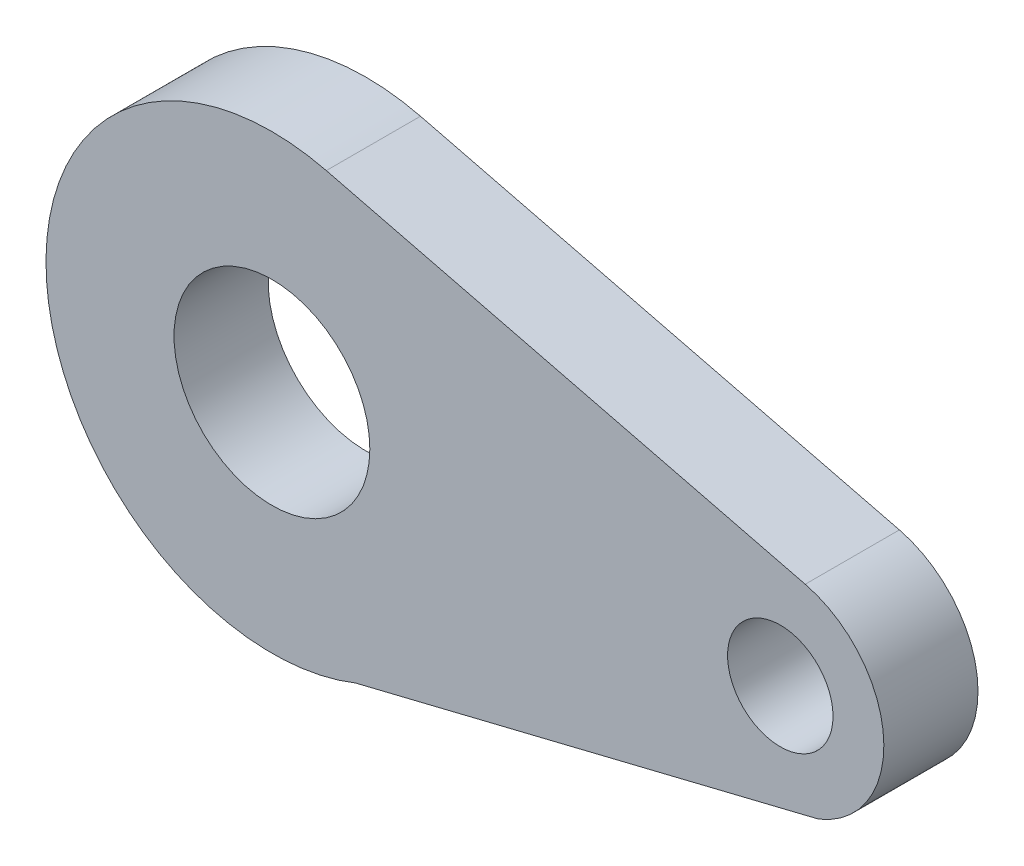
ISO-10303-21;
HEADER;
FILE_DESCRIPTION(('STEP AP214'),'2;1');
FILE_NAME('part.step','',(''),(''),'','','');
FILE_SCHEMA(('AUTOMOTIVE_DESIGN { 1 0 10303 214 1 1 1 1 }'));
ENDSEC;
DATA;
#1=APPLICATION_CONTEXT('core data for automotive mechanical design processes');
#2=APPLICATION_PROTOCOL_DEFINITION('international standard','automotive_design',2000,#1);
#3=PRODUCT_CONTEXT('',#1,'mechanical');
#4=PRODUCT('Part','Part','',(#3));
#5=PRODUCT_RELATED_PRODUCT_CATEGORY('part','',(#4));
#6=PRODUCT_DEFINITION_FORMATION('','',#4);
#7=PRODUCT_DEFINITION_CONTEXT('part definition',#1,'design');
#8=PRODUCT_DEFINITION('design','',#6,#7);
#9=PRODUCT_DEFINITION_SHAPE('','',#8);
#10=(LENGTH_UNIT() NAMED_UNIT(*) SI_UNIT(.MILLI.,.METRE.));
#11=(NAMED_UNIT(*) PLANE_ANGLE_UNIT() SI_UNIT($,.RADIAN.));
#12=(NAMED_UNIT(*) SI_UNIT($,.STERADIAN.) SOLID_ANGLE_UNIT());
#13=UNCERTAINTY_MEASURE_WITH_UNIT(LENGTH_MEASURE(1.E-05),#10,'distance_accuracy_value','');
#14=(GEOMETRIC_REPRESENTATION_CONTEXT(3) GLOBAL_UNCERTAINTY_ASSIGNED_CONTEXT((#13)) GLOBAL_UNIT_ASSIGNED_CONTEXT((#10,
#11,#12)) REPRESENTATION_CONTEXT('',''));
#15=CARTESIAN_POINT('',(0.,0.,0.));
#16=DIRECTION('',(0.,0.,1.));
#17=DIRECTION('',(1.,0.,0.));
#18=AXIS2_PLACEMENT_3D('',#15,#16,#17);
#19=CARTESIAN_POINT('',(0.,0.,2.5));
#20=DIRECTION('',(0.,0.,1.));
#21=DIRECTION('',(1.,0.,0.));
#22=AXIS2_PLACEMENT_3D('',#19,#20,#21);
#23=PLANE('',#22);
#24=CARTESIAN_POINT('',(0.,0.,2.5));
#25=DIRECTION('',(0.,0.,1.));
#26=DIRECTION('',(1.,0.,0.));
#27=AXIS2_PLACEMENT_3D('',#24,#25,#26);
#28=CIRCLE('',#27,2.6);
#29=CARTESIAN_POINT('',(2.6,0.,2.5));
#30=VERTEX_POINT('',#29);
#31=EDGE_CURVE('E100',#30,#30,#28,.T.);
#32=ORIENTED_EDGE('',*,*,#31,.F.);
#33=EDGE_LOOP('',(#32));
#34=FACE_BOUND('',#33,.T.);
#35=CARTESIAN_POINT('',(0.,0.,2.5));
#36=DIRECTION('',(0.,0.,1.));
#37=DIRECTION('',(1.,0.,0.));
#38=AXIS2_PLACEMENT_3D('',#35,#36,#37);
#39=CIRCLE('',#38,6.);
#40=CARTESIAN_POINT('',(1.44444444444445,5.8235367472794,2.5));
#41=VERTEX_POINT('',#40);
#42=CARTESIAN_POINT('',(2.22222222222222,-5.57330497954865,2.5));
#43=VERTEX_POINT('',#42);
#44=EDGE_CURVE('E85',#41,#43,#39,.T.);
#45=ORIENTED_EDGE('',*,*,#44,.T.);
#46=DIRECTION('',(0.971159641560586,0.238430179725458,0.));
#47=VECTOR('',#46,1.);
#48=CARTESIAN_POINT('',(14.5185185185185,-2.5544314489598,2.5));
#49=LINE('',#48,#47);
#50=CARTESIAN_POINT('',(14.5185185185185,-2.5544314489598,2.5));
#51=VERTEX_POINT('',#50);
#52=EDGE_CURVE('E80',#43,#51,#49,.T.);
#53=ORIENTED_EDGE('',*,*,#52,.T.);
#54=CARTESIAN_POINT('',(13.5,0.,2.5));
#55=DIRECTION('',(0.,0.,1.));
#56=DIRECTION('',(1.,0.,0.));
#57=AXIS2_PLACEMENT_3D('',#54,#55,#56);
#58=CIRCLE('',#57,2.75);
#59=CARTESIAN_POINT('',(14.162037037037,2.66912100916973,2.5));
#60=VERTEX_POINT('',#59);
#61=EDGE_CURVE('E83',#51,#60,#58,.T.);
#62=ORIENTED_EDGE('',*,*,#61,.T.);
#63=DIRECTION('',(-0.970589457879901,0.240740740740741,0.));
#64=VECTOR('',#63,1.);
#65=CARTESIAN_POINT('',(1.44444444444445,5.8235367472794,2.5));
#66=LINE('',#65,#64);
#67=EDGE_CURVE('E50',#60,#41,#66,.T.);
#68=ORIENTED_EDGE('',*,*,#67,.T.);
#69=EDGE_LOOP('',(#45,#53,#62,#68));
#70=FACE_BOUND('',#69,.T.);
#71=CARTESIAN_POINT('',(13.5,0.,2.5));
#72=DIRECTION('',(0.,0.,1.));
#73=DIRECTION('',(1.,0.,0.));
#74=AXIS2_PLACEMENT_3D('',#71,#72,#73);
#75=CIRCLE('',#74,1.4);
#76=CARTESIAN_POINT('',(14.9,0.,2.5));
#77=VERTEX_POINT('',#76);
#78=EDGE_CURVE('E115',#77,#77,#75,.T.);
#79=ORIENTED_EDGE('',*,*,#78,.F.);
#80=EDGE_LOOP('',(#79));
#81=FACE_BOUND('',#80,.T.);
#82=ADVANCED_FACE('F33',(#34,#70,#81),#23,.T.);
#83=CARTESIAN_POINT('',(0.,0.,0.));
#84=DIRECTION('',(0.,0.,1.));
#85=DIRECTION('',(1.,0.,0.));
#86=AXIS2_PLACEMENT_3D('',#83,#84,#85);
#87=PLANE('',#86);
#88=CARTESIAN_POINT('',(0.,0.,0.));
#89=DIRECTION('',(0.,0.,1.));
#90=DIRECTION('',(1.,0.,0.));
#91=AXIS2_PLACEMENT_3D('',#88,#89,#90);
#92=CIRCLE('',#91,2.6);
#93=CARTESIAN_POINT('',(2.6,0.,0.));
#94=VERTEX_POINT('',#93);
#95=EDGE_CURVE('E112',#94,#94,#92,.T.);
#96=ORIENTED_EDGE('',*,*,#95,.T.);
#97=EDGE_LOOP('',(#96));
#98=FACE_BOUND('',#97,.T.);
#99=CARTESIAN_POINT('',(0.,0.,0.));
#100=DIRECTION('',(0.,0.,1.));
#101=DIRECTION('',(1.,0.,0.));
#102=AXIS2_PLACEMENT_3D('',#99,#100,#101);
#103=CIRCLE('',#102,6.);
#104=CARTESIAN_POINT('',(1.44444444444445,5.8235367472794,0.));
#105=VERTEX_POINT('',#104);
#106=CARTESIAN_POINT('',(2.22222222222222,-5.57330497954865,0.));
#107=VERTEX_POINT('',#106);
#108=EDGE_CURVE('E97',#105,#107,#103,.T.);
#109=ORIENTED_EDGE('',*,*,#108,.F.);
#110=DIRECTION('',(-0.970589457879901,0.240740740740741,0.));
#111=VECTOR('',#110,1.);
#112=CARTESIAN_POINT('',(1.44444444444445,5.8235367472794,0.));
#113=LINE('',#112,#111);
#114=CARTESIAN_POINT('',(14.162037037037,2.66912100916973,0.));
#115=VERTEX_POINT('',#114);
#116=EDGE_CURVE('E73',#115,#105,#113,.T.);
#117=ORIENTED_EDGE('',*,*,#116,.F.);
#118=CARTESIAN_POINT('',(13.5,0.,0.));
#119=DIRECTION('',(0.,0.,1.));
#120=DIRECTION('',(1.,0.,0.));
#121=AXIS2_PLACEMENT_3D('',#118,#119,#120);
#122=CIRCLE('',#121,2.75);
#123=CARTESIAN_POINT('',(14.5185185185185,-2.5544314489598,0.));
#124=VERTEX_POINT('',#123);
#125=EDGE_CURVE('E67',#124,#115,#122,.T.);
#126=ORIENTED_EDGE('',*,*,#125,.F.);
#127=DIRECTION('',(0.971159641560586,0.238430179725458,0.));
#128=VECTOR('',#127,1.);
#129=CARTESIAN_POINT('',(14.5185185185185,-2.5544314489598,0.));
#130=LINE('',#129,#128);
#131=EDGE_CURVE('E89',#107,#124,#130,.T.);
#132=ORIENTED_EDGE('',*,*,#131,.F.);
#133=EDGE_LOOP('',(#109,#117,#126,#132));
#134=FACE_BOUND('',#133,.T.);
#135=CARTESIAN_POINT('',(13.5,0.,0.));
#136=DIRECTION('',(0.,0.,1.));
#137=DIRECTION('',(1.,0.,0.));
#138=AXIS2_PLACEMENT_3D('',#135,#136,#137);
#139=CIRCLE('',#138,1.4);
#140=CARTESIAN_POINT('',(14.9,0.,0.));
#141=VERTEX_POINT('',#140);
#142=EDGE_CURVE('E118',#141,#141,#139,.T.);
#143=ORIENTED_EDGE('',*,*,#142,.T.);
#144=EDGE_LOOP('',(#143));
#145=FACE_BOUND('',#144,.T.);
#146=ADVANCED_FACE('F108',(#98,#134,#145),#87,.F.);
#147=CARTESIAN_POINT('',(0.,0.,2.5));
#148=DIRECTION('',(0.,0.,-1.));
#149=DIRECTION('',(-1.,0.,0.));
#150=AXIS2_PLACEMENT_3D('',#147,#148,#149);
#151=CYLINDRICAL_SURFACE('',#150,6.);
#152=ORIENTED_EDGE('',*,*,#108,.T.);
#153=DIRECTION('',(0.,0.,-1.));
#154=VECTOR('',#153,1.);
#155=CARTESIAN_POINT('',(2.22222222222222,-5.57330497954865,2.5));
#156=LINE('',#155,#154);
#157=EDGE_CURVE('E11',#43,#107,#156,.T.);
#158=ORIENTED_EDGE('',*,*,#157,.F.);
#159=ORIENTED_EDGE('',*,*,#44,.F.);
#160=DIRECTION('',(0.,0.,-1.));
#161=VECTOR('',#160,1.);
#162=CARTESIAN_POINT('',(1.44444444444445,5.8235367472794,2.5));
#163=LINE('',#162,#161);
#164=EDGE_CURVE('E93',#41,#105,#163,.T.);
#165=ORIENTED_EDGE('',*,*,#164,.T.);
#166=EDGE_LOOP('',(#152,#158,#159,#165));
#167=FACE_BOUND('',#166,.T.);
#168=ADVANCED_FACE('F35',(#167),#151,.T.);
#169=CARTESIAN_POINT('',(14.5185185185185,-2.5544314489598,2.5));
#170=DIRECTION('',(-0.238430179725458,0.971159641560586,0.));
#171=DIRECTION('',(-0.971159641560586,-0.238430179725458,0.));
#172=AXIS2_PLACEMENT_3D('',#169,#170,#171);
#173=PLANE('',#172);
#174=ORIENTED_EDGE('',*,*,#131,.T.);
#175=DIRECTION('',(0.,0.,-1.));
#176=VECTOR('',#175,1.);
#177=CARTESIAN_POINT('',(14.5185185185185,-2.5544314489598,2.5));
#178=LINE('',#177,#176);
#179=EDGE_CURVE('E42',#51,#124,#178,.T.);
#180=ORIENTED_EDGE('',*,*,#179,.F.);
#181=ORIENTED_EDGE('',*,*,#52,.F.);
#182=ORIENTED_EDGE('',*,*,#157,.T.);
#183=EDGE_LOOP('',(#174,#180,#181,#182));
#184=FACE_BOUND('',#183,.T.);
#185=ADVANCED_FACE('F88',(#184),#173,.F.);
#186=CARTESIAN_POINT('',(13.5,0.,2.5));
#187=DIRECTION('',(0.,0.,-1.));
#188=DIRECTION('',(-1.,0.,0.));
#189=AXIS2_PLACEMENT_3D('',#186,#187,#188);
#190=CYLINDRICAL_SURFACE('',#189,2.75);
#191=ORIENTED_EDGE('',*,*,#125,.T.);
#192=DIRECTION('',(0.,0.,-1.));
#193=VECTOR('',#192,1.);
#194=CARTESIAN_POINT('',(14.162037037037,2.66912100916973,2.5));
#195=LINE('',#194,#193);
#196=EDGE_CURVE('E90',#60,#115,#195,.T.);
#197=ORIENTED_EDGE('',*,*,#196,.F.);
#198=ORIENTED_EDGE('',*,*,#61,.F.);
#199=ORIENTED_EDGE('',*,*,#179,.T.);
#200=EDGE_LOOP('',(#191,#197,#198,#199));
#201=FACE_BOUND('',#200,.T.);
#202=ADVANCED_FACE('F91',(#201),#190,.T.);
#203=CARTESIAN_POINT('',(1.44444444444445,5.8235367472794,2.5));
#204=DIRECTION('',(-0.240740740740741,-0.970589457879901,0.));
#205=DIRECTION('',(0.970589457879901,-0.240740740740741,0.));
#206=AXIS2_PLACEMENT_3D('',#203,#204,#205);
#207=PLANE('',#206);
#208=ORIENTED_EDGE('',*,*,#116,.T.);
#209=ORIENTED_EDGE('',*,*,#164,.F.);
#210=ORIENTED_EDGE('',*,*,#67,.F.);
#211=ORIENTED_EDGE('',*,*,#196,.T.);
#212=EDGE_LOOP('',(#208,#209,#210,#211));
#213=FACE_BOUND('',#212,.T.);
#214=ADVANCED_FACE('F105',(#213),#207,.F.);
#215=CARTESIAN_POINT('',(0.,0.,2.5));
#216=DIRECTION('',(0.,0.,-1.));
#217=DIRECTION('',(-1.,0.,0.));
#218=AXIS2_PLACEMENT_3D('',#215,#216,#217);
#219=CYLINDRICAL_SURFACE('',#218,2.6);
#220=ORIENTED_EDGE('',*,*,#31,.T.);
#221=EDGE_LOOP('',(#220));
#222=FACE_BOUND('',#221,.T.);
#223=ORIENTED_EDGE('',*,*,#95,.F.);
#224=EDGE_LOOP('',(#223));
#225=FACE_BOUND('',#224,.T.);
#226=ADVANCED_FACE('F136',(#222,#225),#219,.F.);
#227=CARTESIAN_POINT('',(13.5,0.,2.5));
#228=DIRECTION('',(0.,0.,-1.));
#229=DIRECTION('',(-1.,0.,0.));
#230=AXIS2_PLACEMENT_3D('',#227,#228,#229);
#231=CYLINDRICAL_SURFACE('',#230,1.4);
#232=ORIENTED_EDGE('',*,*,#78,.T.);
#233=EDGE_LOOP('',(#232));
#234=FACE_BOUND('',#233,.T.);
#235=ORIENTED_EDGE('',*,*,#142,.F.);
#236=EDGE_LOOP('',(#235));
#237=FACE_BOUND('',#236,.T.);
#238=ADVANCED_FACE('F124',(#234,#237),#231,.F.);
#239=CLOSED_SHELL('',(#82,#146,#168,#185,#202,#214,#226,#238));
#240=MANIFOLD_SOLID_BREP('B2',#239);
#241=ADVANCED_BREP_SHAPE_REPRESENTATION('',(#18,#240),#14);
#242=SHAPE_DEFINITION_REPRESENTATION(#9,#241);
ENDSEC;
END-ISO-10303-21;
